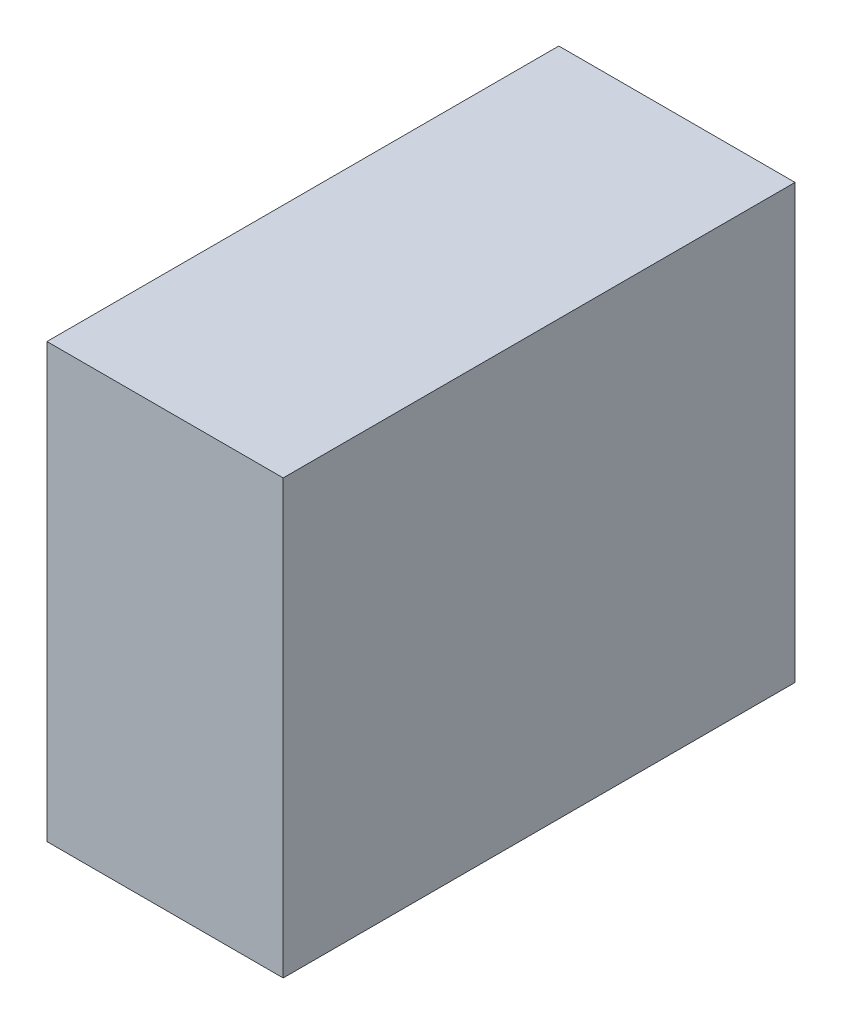
ISO-10303-21;
HEADER;
FILE_DESCRIPTION(('STEP AP214'),'2;1');
FILE_NAME('part.step','',(''),(''),'','','');
FILE_SCHEMA(('AUTOMOTIVE_DESIGN { 1 0 10303 214 1 1 1 1 }'));
ENDSEC;
DATA;
#1=APPLICATION_CONTEXT('core data for automotive mechanical design processes');
#2=APPLICATION_PROTOCOL_DEFINITION('international standard','automotive_design',2000,#1);
#3=PRODUCT_CONTEXT('',#1,'mechanical');
#4=PRODUCT('Part','Part','',(#3));
#5=PRODUCT_RELATED_PRODUCT_CATEGORY('part','',(#4));
#6=PRODUCT_DEFINITION_FORMATION('','',#4);
#7=PRODUCT_DEFINITION_CONTEXT('part definition',#1,'design');
#8=PRODUCT_DEFINITION('design','',#6,#7);
#9=PRODUCT_DEFINITION_SHAPE('','',#8);
#10=(LENGTH_UNIT() NAMED_UNIT(*) SI_UNIT(.MILLI.,.METRE.));
#11=(NAMED_UNIT(*) PLANE_ANGLE_UNIT() SI_UNIT($,.RADIAN.));
#12=(NAMED_UNIT(*) SI_UNIT($,.STERADIAN.) SOLID_ANGLE_UNIT());
#13=UNCERTAINTY_MEASURE_WITH_UNIT(LENGTH_MEASURE(1.E-05),#10,'distance_accuracy_value','');
#14=(GEOMETRIC_REPRESENTATION_CONTEXT(3) GLOBAL_UNCERTAINTY_ASSIGNED_CONTEXT((#13)) GLOBAL_UNIT_ASSIGNED_CONTEXT((#10,
#11,#12)) REPRESENTATION_CONTEXT('',''));
#15=CARTESIAN_POINT('',(0.,0.,0.));
#16=DIRECTION('',(0.,0.,1.));
#17=DIRECTION('',(1.,0.,0.));
#18=AXIS2_PLACEMENT_3D('',#15,#16,#17);
#19=CARTESIAN_POINT('',(0.2999994,-0.5499989,0.));
#20=DIRECTION('',(-1.,0.,0.));
#21=DIRECTION('',(0.,0.,1.));
#22=AXIS2_PLACEMENT_3D('',#19,#20,#21);
#23=PLANE('',#22);
#24=DIRECTION('',(0.,0.,-1.));
#25=VECTOR('',#24,1.);
#26=CARTESIAN_POINT('',(0.2999994,0.5499989,0.));
#27=LINE('',#26,#25);
#28=CARTESIAN_POINT('',(0.2999994,0.5499989,0.));
#29=VERTEX_POINT('',#28);
#30=CARTESIAN_POINT('',(0.2999994,0.5499989,1.29999994));
#31=VERTEX_POINT('',#30);
#32=EDGE_CURVE('E20',#29,#31,#27,.F.);
#33=ORIENTED_EDGE('',*,*,#32,.T.);
#34=DIRECTION('',(0.,1.,0.));
#35=VECTOR('',#34,1.);
#36=CARTESIAN_POINT('',(0.2999994,0.5499989,1.29999994));
#37=LINE('',#36,#35);
#38=CARTESIAN_POINT('',(0.2999994,-0.5499989,1.29999994));
#39=VERTEX_POINT('',#38);
#40=EDGE_CURVE('E55',#31,#39,#37,.F.);
#41=ORIENTED_EDGE('',*,*,#40,.T.);
#42=DIRECTION('',(0.,0.,1.));
#43=VECTOR('',#42,1.);
#44=CARTESIAN_POINT('',(0.2999994,-0.5499989,0.));
#45=LINE('',#44,#43);
#46=CARTESIAN_POINT('',(0.2999994,-0.5499989,0.));
#47=VERTEX_POINT('',#46);
#48=EDGE_CURVE('E76',#39,#47,#45,.F.);
#49=ORIENTED_EDGE('',*,*,#48,.T.);
#50=DIRECTION('',(0.,1.,0.));
#51=VECTOR('',#50,1.);
#52=CARTESIAN_POINT('',(0.2999994,0.5499989,0.));
#53=LINE('',#52,#51);
#54=EDGE_CURVE('E58',#29,#47,#53,.F.);
#55=ORIENTED_EDGE('',*,*,#54,.F.);
#56=EDGE_LOOP('',(#33,#41,#49,#55));
#57=FACE_BOUND('',#56,.T.);
#58=ADVANCED_FACE('F17',(#57),#23,.F.);
#59=CARTESIAN_POINT('',(0.2999994,0.5499989,0.));
#60=DIRECTION('',(0.,-1.,0.));
#61=DIRECTION('',(0.,0.,-1.));
#62=AXIS2_PLACEMENT_3D('',#59,#60,#61);
#63=PLANE('',#62);
#64=DIRECTION('',(0.,0.,-1.));
#65=VECTOR('',#64,1.);
#66=CARTESIAN_POINT('',(-0.2999994,0.5499989,0.));
#67=LINE('',#66,#65);
#68=CARTESIAN_POINT('',(-0.2999994,0.5499989,0.));
#69=VERTEX_POINT('',#68);
#70=CARTESIAN_POINT('',(-0.2999994,0.5499989,1.29999994));
#71=VERTEX_POINT('',#70);
#72=EDGE_CURVE('E73',#69,#71,#67,.F.);
#73=ORIENTED_EDGE('',*,*,#72,.T.);
#74=DIRECTION('',(-1.,0.,0.));
#75=VECTOR('',#74,1.);
#76=CARTESIAN_POINT('',(-0.2999994,0.5499989,1.29999994));
#77=LINE('',#76,#75);
#78=EDGE_CURVE('E63',#71,#31,#77,.F.);
#79=ORIENTED_EDGE('',*,*,#78,.T.);
#80=ORIENTED_EDGE('',*,*,#32,.F.);
#81=DIRECTION('',(-1.,0.,0.));
#82=VECTOR('',#81,1.);
#83=CARTESIAN_POINT('',(-0.2999994,0.5499989,0.));
#84=LINE('',#83,#82);
#85=EDGE_CURVE('E78',#69,#29,#84,.F.);
#86=ORIENTED_EDGE('',*,*,#85,.F.);
#87=EDGE_LOOP('',(#73,#79,#80,#86));
#88=FACE_BOUND('',#87,.T.);
#89=ADVANCED_FACE('F72',(#88),#63,.F.);
#90=CARTESIAN_POINT('',(-0.2999994,0.5499989,1.29999994));
#91=DIRECTION('',(0.,0.,-1.));
#92=DIRECTION('',(-1.,0.,0.));
#93=AXIS2_PLACEMENT_3D('',#90,#91,#92);
#94=PLANE('',#93);
#95=DIRECTION('',(1.,0.,0.));
#96=VECTOR('',#95,1.);
#97=CARTESIAN_POINT('',(-0.2999994,-0.5499989,1.29999994));
#98=LINE('',#97,#96);
#99=CARTESIAN_POINT('',(-0.2999994,-0.5499989,1.29999994));
#100=VERTEX_POINT('',#99);
#101=EDGE_CURVE('E69',#100,#39,#98,.T.);
#102=ORIENTED_EDGE('',*,*,#101,.T.);
#103=ORIENTED_EDGE('',*,*,#40,.F.);
#104=ORIENTED_EDGE('',*,*,#78,.F.);
#105=DIRECTION('',(0.,1.,0.));
#106=VECTOR('',#105,1.);
#107=CARTESIAN_POINT('',(-0.2999994,0.5499989,1.29999994));
#108=LINE('',#107,#106);
#109=EDGE_CURVE('E83',#71,#100,#108,.F.);
#110=ORIENTED_EDGE('',*,*,#109,.T.);
#111=EDGE_LOOP('',(#102,#103,#104,#110));
#112=FACE_BOUND('',#111,.T.);
#113=ADVANCED_FACE('F66',(#112),#94,.F.);
#114=CARTESIAN_POINT('',(-0.2999994,-0.5499989,0.));
#115=DIRECTION('',(0.,1.,0.));
#116=DIRECTION('',(0.,0.,1.));
#117=AXIS2_PLACEMENT_3D('',#114,#115,#116);
#118=PLANE('',#117);
#119=ORIENTED_EDGE('',*,*,#48,.F.);
#120=ORIENTED_EDGE('',*,*,#101,.F.);
#121=DIRECTION('',(0.,0.,-1.));
#122=VECTOR('',#121,1.);
#123=CARTESIAN_POINT('',(-0.2999994,-0.5499989,0.));
#124=LINE('',#123,#122);
#125=CARTESIAN_POINT('',(-0.2999994,-0.5499989,0.));
#126=VERTEX_POINT('',#125);
#127=EDGE_CURVE('E26',#100,#126,#124,.T.);
#128=ORIENTED_EDGE('',*,*,#127,.T.);
#129=DIRECTION('',(-1.,0.,0.));
#130=VECTOR('',#129,1.);
#131=CARTESIAN_POINT('',(-0.2999994,-0.5499989,0.));
#132=LINE('',#131,#130);
#133=EDGE_CURVE('E34',#47,#126,#132,.T.);
#134=ORIENTED_EDGE('',*,*,#133,.F.);
#135=EDGE_LOOP('',(#119,#120,#128,#134));
#136=FACE_BOUND('',#135,.T.);
#137=ADVANCED_FACE('F88',(#136),#118,.F.);
#138=CARTESIAN_POINT('',(-0.2999994,0.5499989,0.));
#139=DIRECTION('',(0.,0.,-1.));
#140=DIRECTION('',(-1.,0.,0.));
#141=AXIS2_PLACEMENT_3D('',#138,#139,#140);
#142=PLANE('',#141);
#143=ORIENTED_EDGE('',*,*,#133,.T.);
#144=DIRECTION('',(0.,1.,0.));
#145=VECTOR('',#144,1.);
#146=CARTESIAN_POINT('',(-0.2999994,0.5499989,0.));
#147=LINE('',#146,#145);
#148=EDGE_CURVE('E11',#126,#69,#147,.T.);
#149=ORIENTED_EDGE('',*,*,#148,.T.);
#150=ORIENTED_EDGE('',*,*,#85,.T.);
#151=ORIENTED_EDGE('',*,*,#54,.T.);
#152=EDGE_LOOP('',(#143,#149,#150,#151));
#153=FACE_BOUND('',#152,.T.);
#154=ADVANCED_FACE('F91',(#153),#142,.T.);
#155=CARTESIAN_POINT('',(-0.2999994,0.5499989,0.));
#156=DIRECTION('',(1.,0.,0.));
#157=DIRECTION('',(0.,0.,-1.));
#158=AXIS2_PLACEMENT_3D('',#155,#156,#157);
#159=PLANE('',#158);
#160=ORIENTED_EDGE('',*,*,#127,.F.);
#161=ORIENTED_EDGE('',*,*,#109,.F.);
#162=ORIENTED_EDGE('',*,*,#72,.F.);
#163=ORIENTED_EDGE('',*,*,#148,.F.);
#164=EDGE_LOOP('',(#160,#161,#162,#163));
#165=FACE_BOUND('',#164,.T.);
#166=ADVANCED_FACE('F90',(#165),#159,.F.);
#167=CLOSED_SHELL('',(#58,#89,#113,#137,#154,#166));
#168=MANIFOLD_SOLID_BREP('B1',#167);
#169=ADVANCED_BREP_SHAPE_REPRESENTATION('',(#18,#168),#14);
#170=SHAPE_DEFINITION_REPRESENTATION(#9,#169);
ENDSEC;
END-ISO-10303-21;
